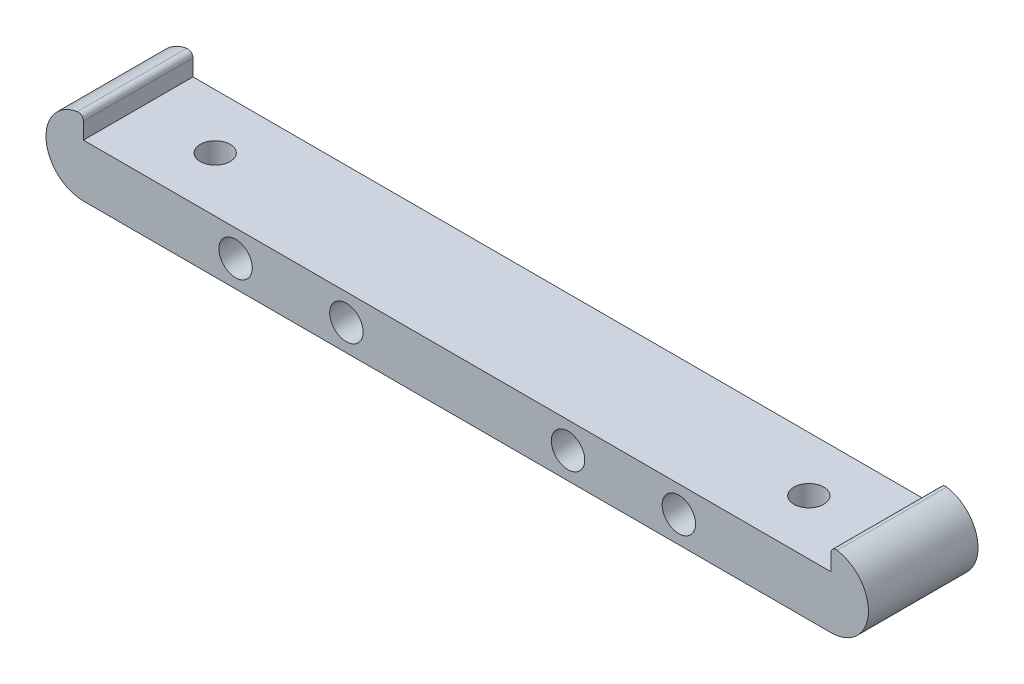
ISO-10303-21;
HEADER;
FILE_DESCRIPTION(('STEP AP214'),'2;1');
FILE_NAME('part.step','',(''),(''),'','','');
FILE_SCHEMA(('AUTOMOTIVE_DESIGN { 1 0 10303 214 1 1 1 1 }'));
ENDSEC;
DATA;
#1=APPLICATION_CONTEXT('core data for automotive mechanical design processes');
#2=APPLICATION_PROTOCOL_DEFINITION('international standard','automotive_design',2000,#1);
#3=PRODUCT_CONTEXT('',#1,'mechanical');
#4=PRODUCT('Part','Part','',(#3));
#5=PRODUCT_RELATED_PRODUCT_CATEGORY('part','',(#4));
#6=PRODUCT_DEFINITION_FORMATION('','',#4);
#7=PRODUCT_DEFINITION_CONTEXT('part definition',#1,'design');
#8=PRODUCT_DEFINITION('design','',#6,#7);
#9=PRODUCT_DEFINITION_SHAPE('','',#8);
#10=(LENGTH_UNIT() NAMED_UNIT(*) SI_UNIT(.MILLI.,.METRE.));
#11=(NAMED_UNIT(*) PLANE_ANGLE_UNIT() SI_UNIT($,.RADIAN.));
#12=(NAMED_UNIT(*) SI_UNIT($,.STERADIAN.) SOLID_ANGLE_UNIT());
#13=UNCERTAINTY_MEASURE_WITH_UNIT(LENGTH_MEASURE(1.E-05),#10,'distance_accuracy_value','');
#14=(GEOMETRIC_REPRESENTATION_CONTEXT(3) GLOBAL_UNCERTAINTY_ASSIGNED_CONTEXT((#13)) GLOBAL_UNIT_ASSIGNED_CONTEXT((#10,
#11,#12)) REPRESENTATION_CONTEXT('',''));
#15=CARTESIAN_POINT('',(0.,0.,0.));
#16=DIRECTION('',(0.,0.,1.));
#17=DIRECTION('',(1.,0.,0.));
#18=AXIS2_PLACEMENT_3D('',#15,#16,#17);
#19=CARTESIAN_POINT('',(0.,5.4102,15.8242));
#20=DIRECTION('',(0.,0.,1.));
#21=DIRECTION('',(1.,0.,0.));
#22=AXIS2_PLACEMENT_3D('',#19,#20,#21);
#23=PLANE('',#22);
#24=CARTESIAN_POINT('',(69.977,3.81,15.8242));
#25=DIRECTION('',(0.,0.,1.));
#26=DIRECTION('',(1.,0.,0.));
#27=AXIS2_PLACEMENT_3D('',#24,#25,#26);
#28=CIRCLE('',#27,2.413);
#29=CARTESIAN_POINT('',(72.39,3.81,15.8242));
#30=VERTEX_POINT('',#29);
#31=EDGE_CURVE('E187',#30,#30,#28,.T.);
#32=ORIENTED_EDGE('',*,*,#31,.F.);
#33=EDGE_LOOP('',(#32));
#34=FACE_BOUND('',#33,.T.);
#35=CARTESIAN_POINT('',(21.971,3.81,15.8242));
#36=DIRECTION('',(0.,0.,1.));
#37=DIRECTION('',(1.,0.,0.));
#38=AXIS2_PLACEMENT_3D('',#35,#36,#37);
#39=CIRCLE('',#38,2.41299999999999);
#40=CARTESIAN_POINT('',(24.384,3.81,15.8242));
#41=VERTEX_POINT('',#40);
#42=EDGE_CURVE('E175',#41,#41,#39,.T.);
#43=ORIENTED_EDGE('',*,*,#42,.F.);
#44=EDGE_LOOP('',(#43));
#45=FACE_BOUND('',#44,.T.);
#46=DIRECTION('',(0.,1.,0.));
#47=VECTOR('',#46,1.);
#48=CARTESIAN_POINT('',(0.,10.8204,15.8242));
#49=LINE('',#48,#47);
#50=CARTESIAN_POINT('',(0.,7.62,15.8242));
#51=VERTEX_POINT('',#50);
#52=CARTESIAN_POINT('',(0.,9.99551560963911,15.8242));
#53=VERTEX_POINT('',#52);
#54=EDGE_CURVE('E163',#51,#53,#49,.T.);
#55=ORIENTED_EDGE('',*,*,#54,.T.);
#56=CARTESIAN_POINT('',(-0.762,9.99551560963911,15.8242));
#57=DIRECTION('',(0.,0.,1.));
#58=DIRECTION('',(1.,0.,0.));
#59=AXIS2_PLACEMENT_3D('',#56,#57,#58);
#60=CIRCLE('',#59,0.762);
#61=CARTESIAN_POINT('',(-0.886918032786885,10.7472066931865,15.8242));
#62=VERTEX_POINT('',#61);
#63=EDGE_CURVE('E102',#53,#62,#60,.T.);
#64=ORIENTED_EDGE('',*,*,#63,.T.);
#65=CARTESIAN_POINT('',(0.,5.4102,15.8242));
#66=DIRECTION('',(0.,0.,1.));
#67=DIRECTION('',(1.,0.,0.));
#68=AXIS2_PLACEMENT_3D('',#65,#66,#67);
#69=CIRCLE('',#68,5.4102);
#70=CARTESIAN_POINT('',(0.,0.,15.8242));
#71=VERTEX_POINT('',#70);
#72=EDGE_CURVE('E95',#62,#71,#69,.T.);
#73=ORIENTED_EDGE('',*,*,#72,.T.);
#74=DIRECTION('',(1.,0.,0.));
#75=VECTOR('',#74,1.);
#76=CARTESIAN_POINT('',(0.,0.,15.8242));
#77=LINE('',#76,#75);
#78=CARTESIAN_POINT('',(107.95,0.,15.8242));
#79=VERTEX_POINT('',#78);
#80=EDGE_CURVE('E99',#71,#79,#77,.T.);
#81=ORIENTED_EDGE('',*,*,#80,.T.);
#82=CARTESIAN_POINT('',(107.95,5.4102,15.8242));
#83=DIRECTION('',(0.,0.,1.));
#84=DIRECTION('',(-1.,0.,0.));
#85=AXIS2_PLACEMENT_3D('',#82,#83,#84);
#86=CIRCLE('',#85,5.4102);
#87=CARTESIAN_POINT('',(108.836918032787,10.7472066931865,15.8242));
#88=VERTEX_POINT('',#87);
#89=EDGE_CURVE('E115',#79,#88,#86,.T.);
#90=ORIENTED_EDGE('',*,*,#89,.T.);
#91=CARTESIAN_POINT('',(108.712,9.99551560963911,15.8242));
#92=DIRECTION('',(0.,0.,1.));
#93=DIRECTION('',(1.,0.,0.));
#94=AXIS2_PLACEMENT_3D('',#91,#92,#93);
#95=CIRCLE('',#94,0.762);
#96=CARTESIAN_POINT('',(107.95,9.99551560963911,15.8242));
#97=VERTEX_POINT('',#96);
#98=EDGE_CURVE('E47',#88,#97,#95,.T.);
#99=ORIENTED_EDGE('',*,*,#98,.T.);
#100=DIRECTION('',(0.,-1.,0.));
#101=VECTOR('',#100,1.);
#102=CARTESIAN_POINT('',(107.95,10.8204,15.8242));
#103=LINE('',#102,#101);
#104=CARTESIAN_POINT('',(107.95,7.62,15.8242));
#105=VERTEX_POINT('',#104);
#106=EDGE_CURVE('E143',#97,#105,#103,.T.);
#107=ORIENTED_EDGE('',*,*,#106,.T.);
#108=DIRECTION('',(-1.,0.,0.));
#109=VECTOR('',#108,1.);
#110=CARTESIAN_POINT('',(0.,7.62,15.8242));
#111=LINE('',#110,#109);
#112=EDGE_CURVE('E168',#105,#51,#111,.T.);
#113=ORIENTED_EDGE('',*,*,#112,.T.);
#114=EDGE_LOOP('',(#55,#64,#73,#81,#90,#99,#107,#113));
#115=FACE_BOUND('',#114,.T.);
#116=CARTESIAN_POINT('',(37.973,3.81,15.8242));
#117=DIRECTION('',(0.,0.,1.));
#118=DIRECTION('',(1.,0.,0.));
#119=AXIS2_PLACEMENT_3D('',#116,#117,#118);
#120=CIRCLE('',#119,2.413);
#121=CARTESIAN_POINT('',(40.386,3.81,15.8242));
#122=VERTEX_POINT('',#121);
#123=EDGE_CURVE('E181',#122,#122,#120,.T.);
#124=ORIENTED_EDGE('',*,*,#123,.F.);
#125=EDGE_LOOP('',(#124));
#126=FACE_BOUND('',#125,.T.);
#127=CARTESIAN_POINT('',(85.979,3.81,15.8242));
#128=DIRECTION('',(0.,0.,1.));
#129=DIRECTION('',(1.,0.,0.));
#130=AXIS2_PLACEMENT_3D('',#127,#128,#129);
#131=CIRCLE('',#130,2.41300000000001);
#132=CARTESIAN_POINT('',(88.392,3.81,15.8242));
#133=VERTEX_POINT('',#132);
#134=EDGE_CURVE('E193',#133,#133,#131,.T.);
#135=ORIENTED_EDGE('',*,*,#134,.F.);
#136=EDGE_LOOP('',(#135));
#137=FACE_BOUND('',#136,.T.);
#138=ADVANCED_FACE('F32',(#34,#45,#115,#126,#137),#23,.T.);
#139=CARTESIAN_POINT('',(0.,5.4102,0.));
#140=DIRECTION('',(0.,0.,1.));
#141=DIRECTION('',(1.,0.,0.));
#142=AXIS2_PLACEMENT_3D('',#139,#140,#141);
#143=PLANE('',#142);
#144=CARTESIAN_POINT('',(0.,5.4102,0.));
#145=DIRECTION('',(0.,0.,1.));
#146=DIRECTION('',(1.,0.,0.));
#147=AXIS2_PLACEMENT_3D('',#144,#145,#146);
#148=CIRCLE('',#147,5.4102);
#149=CARTESIAN_POINT('',(-0.886918032786885,10.7472066931865,0.));
#150=VERTEX_POINT('',#149);
#151=CARTESIAN_POINT('',(0.,0.,0.));
#152=VERTEX_POINT('',#151);
#153=EDGE_CURVE('E119',#150,#152,#148,.T.);
#154=ORIENTED_EDGE('',*,*,#153,.F.);
#155=CARTESIAN_POINT('',(-0.762,9.99551560963911,0.));
#156=DIRECTION('',(0.,0.,1.));
#157=DIRECTION('',(1.,0.,0.));
#158=AXIS2_PLACEMENT_3D('',#155,#156,#157);
#159=CIRCLE('',#158,0.762);
#160=CARTESIAN_POINT('',(0.,9.99551560963911,0.));
#161=VERTEX_POINT('',#160);
#162=EDGE_CURVE('E130',#150,#161,#159,.F.);
#163=ORIENTED_EDGE('',*,*,#162,.T.);
#164=DIRECTION('',(0.,1.,0.));
#165=VECTOR('',#164,1.);
#166=CARTESIAN_POINT('',(0.,10.8204,0.));
#167=LINE('',#166,#165);
#168=CARTESIAN_POINT('',(0.,7.62,0.));
#169=VERTEX_POINT('',#168);
#170=EDGE_CURVE('E107',#169,#161,#167,.T.);
#171=ORIENTED_EDGE('',*,*,#170,.F.);
#172=DIRECTION('',(-1.,0.,0.));
#173=VECTOR('',#172,1.);
#174=CARTESIAN_POINT('',(0.,7.62,0.));
#175=LINE('',#174,#173);
#176=CARTESIAN_POINT('',(107.95,7.62,0.));
#177=VERTEX_POINT('',#176);
#178=EDGE_CURVE('E151',#177,#169,#175,.T.);
#179=ORIENTED_EDGE('',*,*,#178,.F.);
#180=DIRECTION('',(0.,-1.,0.));
#181=VECTOR('',#180,1.);
#182=CARTESIAN_POINT('',(107.95,10.8204,0.));
#183=LINE('',#182,#181);
#184=CARTESIAN_POINT('',(107.95,9.99551560963911,0.));
#185=VERTEX_POINT('',#184);
#186=EDGE_CURVE('E141',#185,#177,#183,.T.);
#187=ORIENTED_EDGE('',*,*,#186,.F.);
#188=CARTESIAN_POINT('',(108.712,9.99551560963911,0.));
#189=DIRECTION('',(0.,0.,1.));
#190=DIRECTION('',(1.,0.,0.));
#191=AXIS2_PLACEMENT_3D('',#188,#189,#190);
#192=CIRCLE('',#191,0.762);
#193=CARTESIAN_POINT('',(108.836918032787,10.7472066931865,0.));
#194=VERTEX_POINT('',#193);
#195=EDGE_CURVE('E123',#185,#194,#192,.F.);
#196=ORIENTED_EDGE('',*,*,#195,.T.);
#197=CARTESIAN_POINT('',(107.95,5.4102,0.));
#198=DIRECTION('',(0.,0.,1.));
#199=DIRECTION('',(-1.,0.,0.));
#200=AXIS2_PLACEMENT_3D('',#197,#198,#199);
#201=CIRCLE('',#200,5.4102);
#202=CARTESIAN_POINT('',(107.95,0.,0.));
#203=VERTEX_POINT('',#202);
#204=EDGE_CURVE('E152',#203,#194,#201,.T.);
#205=ORIENTED_EDGE('',*,*,#204,.F.);
#206=DIRECTION('',(1.,0.,0.));
#207=VECTOR('',#206,1.);
#208=CARTESIAN_POINT('',(0.,0.,0.));
#209=LINE('',#208,#207);
#210=EDGE_CURVE('E155',#152,#203,#209,.T.);
#211=ORIENTED_EDGE('',*,*,#210,.F.);
#212=EDGE_LOOP('',(#154,#163,#171,#179,#187,#196,#205,#211));
#213=FACE_BOUND('',#212,.T.);
#214=CARTESIAN_POINT('',(21.971,3.81,0.));
#215=DIRECTION('',(0.,0.,1.));
#216=DIRECTION('',(1.,0.,0.));
#217=AXIS2_PLACEMENT_3D('',#214,#215,#216);
#218=CIRCLE('',#217,2.41299999999999);
#219=CARTESIAN_POINT('',(24.384,3.81,0.));
#220=VERTEX_POINT('',#219);
#221=EDGE_CURVE('E178',#220,#220,#218,.T.);
#222=ORIENTED_EDGE('',*,*,#221,.T.);
#223=EDGE_LOOP('',(#222));
#224=FACE_BOUND('',#223,.T.);
#225=CARTESIAN_POINT('',(37.973,3.81,0.));
#226=DIRECTION('',(0.,0.,1.));
#227=DIRECTION('',(1.,0.,0.));
#228=AXIS2_PLACEMENT_3D('',#225,#226,#227);
#229=CIRCLE('',#228,2.413);
#230=CARTESIAN_POINT('',(40.386,3.81,0.));
#231=VERTEX_POINT('',#230);
#232=EDGE_CURVE('E184',#231,#231,#229,.T.);
#233=ORIENTED_EDGE('',*,*,#232,.T.);
#234=EDGE_LOOP('',(#233));
#235=FACE_BOUND('',#234,.T.);
#236=CARTESIAN_POINT('',(69.977,3.81,0.));
#237=DIRECTION('',(0.,0.,1.));
#238=DIRECTION('',(1.,0.,0.));
#239=AXIS2_PLACEMENT_3D('',#236,#237,#238);
#240=CIRCLE('',#239,2.413);
#241=CARTESIAN_POINT('',(72.39,3.81,0.));
#242=VERTEX_POINT('',#241);
#243=EDGE_CURVE('E190',#242,#242,#240,.T.);
#244=ORIENTED_EDGE('',*,*,#243,.T.);
#245=EDGE_LOOP('',(#244));
#246=FACE_BOUND('',#245,.T.);
#247=CARTESIAN_POINT('',(85.979,3.81,0.));
#248=DIRECTION('',(0.,0.,1.));
#249=DIRECTION('',(1.,0.,0.));
#250=AXIS2_PLACEMENT_3D('',#247,#248,#249);
#251=CIRCLE('',#250,2.41300000000001);
#252=CARTESIAN_POINT('',(88.392,3.81,0.));
#253=VERTEX_POINT('',#252);
#254=EDGE_CURVE('E196',#253,#253,#251,.T.);
#255=ORIENTED_EDGE('',*,*,#254,.T.);
#256=EDGE_LOOP('',(#255));
#257=FACE_BOUND('',#256,.T.);
#258=ADVANCED_FACE('F147',(#213,#224,#235,#246,#257),#143,.F.);
#259=CARTESIAN_POINT('',(0.,5.4102,15.8242));
#260=DIRECTION('',(0.,0.,-1.));
#261=DIRECTION('',(-1.,0.,0.));
#262=AXIS2_PLACEMENT_3D('',#259,#260,#261);
#263=CYLINDRICAL_SURFACE('',#262,5.4102);
#264=ORIENTED_EDGE('',*,*,#72,.F.);
#265=DIRECTION('',(0.,0.,-1.));
#266=VECTOR('',#265,1.);
#267=CARTESIAN_POINT('',(-0.886918032786885,10.7472066931865,15.8242));
#268=LINE('',#267,#266);
#269=EDGE_CURVE('E121',#62,#150,#268,.T.);
#270=ORIENTED_EDGE('',*,*,#269,.T.);
#271=ORIENTED_EDGE('',*,*,#153,.T.);
#272=DIRECTION('',(0.,0.,-1.));
#273=VECTOR('',#272,1.);
#274=CARTESIAN_POINT('',(0.,0.,15.8242));
#275=LINE('',#274,#273);
#276=EDGE_CURVE('E112',#71,#152,#275,.T.);
#277=ORIENTED_EDGE('',*,*,#276,.F.);
#278=EDGE_LOOP('',(#264,#270,#271,#277));
#279=FACE_BOUND('',#278,.T.);
#280=ADVANCED_FACE('F117',(#279),#263,.T.);
#281=CARTESIAN_POINT('',(0.,0.,15.8242));
#282=DIRECTION('',(0.,1.,0.));
#283=DIRECTION('',(0.,0.,1.));
#284=AXIS2_PLACEMENT_3D('',#281,#282,#283);
#285=PLANE('',#284);
#286=CARTESIAN_POINT('',(96.8375,0.,7.91209999999995));
#287=DIRECTION('',(0.,1.,0.));
#288=DIRECTION('',(0.,0.,1.));
#289=AXIS2_PLACEMENT_3D('',#286,#287,#288);
#290=CIRCLE('',#289,2.15899999999999);
#291=CARTESIAN_POINT('',(96.8375,0.,10.0710999999999));
#292=VERTEX_POINT('',#291);
#293=EDGE_CURVE('E199',#292,#292,#290,.F.);
#294=ORIENTED_EDGE('',*,*,#293,.F.);
#295=EDGE_LOOP('',(#294));
#296=FACE_BOUND('',#295,.T.);
#297=CARTESIAN_POINT('',(11.1125,0.,7.9121));
#298=DIRECTION('',(0.,1.,0.));
#299=DIRECTION('',(0.,0.,1.));
#300=AXIS2_PLACEMENT_3D('',#297,#298,#299);
#301=CIRCLE('',#300,2.159);
#302=CARTESIAN_POINT('',(11.1125,0.,10.0711));
#303=VERTEX_POINT('',#302);
#304=EDGE_CURVE('E202',#303,#303,#301,.F.);
#305=ORIENTED_EDGE('',*,*,#304,.F.);
#306=EDGE_LOOP('',(#305));
#307=FACE_BOUND('',#306,.T.);
#308=ORIENTED_EDGE('',*,*,#210,.T.);
#309=DIRECTION('',(0.,0.,-1.));
#310=VECTOR('',#309,1.);
#311=CARTESIAN_POINT('',(107.95,0.,15.8242));
#312=LINE('',#311,#310);
#313=EDGE_CURVE('E114',#79,#203,#312,.T.);
#314=ORIENTED_EDGE('',*,*,#313,.F.);
#315=ORIENTED_EDGE('',*,*,#80,.F.);
#316=ORIENTED_EDGE('',*,*,#276,.T.);
#317=EDGE_LOOP('',(#308,#314,#315,#316));
#318=FACE_BOUND('',#317,.T.);
#319=ADVANCED_FACE('F111',(#296,#307,#318),#285,.F.);
#320=CARTESIAN_POINT('',(107.95,5.4102,15.8242));
#321=DIRECTION('',(0.,0.,-1.));
#322=DIRECTION('',(-1.,0.,0.));
#323=AXIS2_PLACEMENT_3D('',#320,#321,#322);
#324=CYLINDRICAL_SURFACE('',#323,5.4102);
#325=ORIENTED_EDGE('',*,*,#204,.T.);
#326=DIRECTION('',(0.,0.,-1.));
#327=VECTOR('',#326,1.);
#328=CARTESIAN_POINT('',(108.836918032787,10.7472066931865,15.8242));
#329=LINE('',#328,#327);
#330=EDGE_CURVE('E11',#194,#88,#329,.F.);
#331=ORIENTED_EDGE('',*,*,#330,.T.);
#332=ORIENTED_EDGE('',*,*,#89,.F.);
#333=ORIENTED_EDGE('',*,*,#313,.T.);
#334=EDGE_LOOP('',(#325,#331,#332,#333));
#335=FACE_BOUND('',#334,.T.);
#336=ADVANCED_FACE('F176',(#335),#324,.T.);
#337=CARTESIAN_POINT('',(107.95,10.8204,15.8242));
#338=DIRECTION('',(1.,0.,0.));
#339=DIRECTION('',(0.,0.,-1.));
#340=AXIS2_PLACEMENT_3D('',#337,#338,#339);
#341=PLANE('',#340);
#342=ORIENTED_EDGE('',*,*,#106,.F.);
#343=DIRECTION('',(0.,0.,-1.));
#344=VECTOR('',#343,1.);
#345=CARTESIAN_POINT('',(107.95,9.99551560963911,15.8242));
#346=LINE('',#345,#344);
#347=EDGE_CURVE('E40',#97,#185,#346,.T.);
#348=ORIENTED_EDGE('',*,*,#347,.T.);
#349=ORIENTED_EDGE('',*,*,#186,.T.);
#350=DIRECTION('',(0.,0.,-1.));
#351=VECTOR('',#350,1.);
#352=CARTESIAN_POINT('',(107.95,7.62,15.8242));
#353=LINE('',#352,#351);
#354=EDGE_CURVE('E125',#105,#177,#353,.T.);
#355=ORIENTED_EDGE('',*,*,#354,.F.);
#356=EDGE_LOOP('',(#342,#348,#349,#355));
#357=FACE_BOUND('',#356,.T.);
#358=ADVANCED_FACE('F139',(#357),#341,.F.);
#359=CARTESIAN_POINT('',(0.,7.62,15.8242));
#360=DIRECTION('',(0.,-1.,0.));
#361=DIRECTION('',(1.,0.,0.));
#362=AXIS2_PLACEMENT_3D('',#359,#360,#361);
#363=PLANE('',#362);
#364=CARTESIAN_POINT('',(96.8375,7.62,7.91209999999995));
#365=DIRECTION('',(0.,1.,0.));
#366=DIRECTION('',(-1.,0.,0.));
#367=AXIS2_PLACEMENT_3D('',#364,#365,#366);
#368=CIRCLE('',#367,2.15899999999999);
#369=CARTESIAN_POINT('',(94.6785,7.62,7.91209999999995));
#370=VERTEX_POINT('',#369);
#371=EDGE_CURVE('E205',#370,#370,#368,.T.);
#372=ORIENTED_EDGE('',*,*,#371,.F.);
#373=EDGE_LOOP('',(#372));
#374=FACE_BOUND('',#373,.T.);
#375=CARTESIAN_POINT('',(11.1125,7.62,7.9121));
#376=DIRECTION('',(0.,1.,0.));
#377=DIRECTION('',(-1.,0.,0.));
#378=AXIS2_PLACEMENT_3D('',#375,#376,#377);
#379=CIRCLE('',#378,2.159);
#380=CARTESIAN_POINT('',(8.9535,7.62,7.9121));
#381=VERTEX_POINT('',#380);
#382=EDGE_CURVE('E206',#381,#381,#379,.T.);
#383=ORIENTED_EDGE('',*,*,#382,.F.);
#384=EDGE_LOOP('',(#383));
#385=FACE_BOUND('',#384,.T.);
#386=ORIENTED_EDGE('',*,*,#178,.T.);
#387=DIRECTION('',(0.,0.,-1.));
#388=VECTOR('',#387,1.);
#389=CARTESIAN_POINT('',(0.,7.62,15.8242));
#390=LINE('',#389,#388);
#391=EDGE_CURVE('E161',#51,#169,#390,.T.);
#392=ORIENTED_EDGE('',*,*,#391,.F.);
#393=ORIENTED_EDGE('',*,*,#112,.F.);
#394=ORIENTED_EDGE('',*,*,#354,.T.);
#395=EDGE_LOOP('',(#386,#392,#393,#394));
#396=FACE_BOUND('',#395,.T.);
#397=ADVANCED_FACE('F166',(#374,#385,#396),#363,.F.);
#398=CARTESIAN_POINT('',(0.,10.8204,15.8242));
#399=DIRECTION('',(-1.,0.,0.));
#400=DIRECTION('',(0.,-1.,0.));
#401=AXIS2_PLACEMENT_3D('',#398,#399,#400);
#402=PLANE('',#401);
#403=ORIENTED_EDGE('',*,*,#170,.T.);
#404=DIRECTION('',(0.,0.,-1.));
#405=VECTOR('',#404,1.);
#406=CARTESIAN_POINT('',(0.,9.99551560963911,15.8242));
#407=LINE('',#406,#405);
#408=EDGE_CURVE('E132',#161,#53,#407,.F.);
#409=ORIENTED_EDGE('',*,*,#408,.T.);
#410=ORIENTED_EDGE('',*,*,#54,.F.);
#411=ORIENTED_EDGE('',*,*,#391,.T.);
#412=EDGE_LOOP('',(#403,#409,#410,#411));
#413=FACE_BOUND('',#412,.T.);
#414=ADVANCED_FACE('F218',(#413),#402,.F.);
#415=CARTESIAN_POINT('',(21.971,3.81,15.8242));
#416=DIRECTION('',(0.,0.,-1.));
#417=DIRECTION('',(-1.,0.,0.));
#418=AXIS2_PLACEMENT_3D('',#415,#416,#417);
#419=CYLINDRICAL_SURFACE('',#418,2.41299999999999);
#420=ORIENTED_EDGE('',*,*,#42,.T.);
#421=EDGE_LOOP('',(#420));
#422=FACE_BOUND('',#421,.T.);
#423=ORIENTED_EDGE('',*,*,#221,.F.);
#424=EDGE_LOOP('',(#423));
#425=FACE_BOUND('',#424,.T.);
#426=ADVANCED_FACE('F248',(#422,#425),#419,.F.);
#427=CARTESIAN_POINT('',(37.973,3.81,15.8242));
#428=DIRECTION('',(0.,0.,-1.));
#429=DIRECTION('',(-1.,0.,0.));
#430=AXIS2_PLACEMENT_3D('',#427,#428,#429);
#431=CYLINDRICAL_SURFACE('',#430,2.413);
#432=ORIENTED_EDGE('',*,*,#123,.T.);
#433=EDGE_LOOP('',(#432));
#434=FACE_BOUND('',#433,.T.);
#435=ORIENTED_EDGE('',*,*,#232,.F.);
#436=EDGE_LOOP('',(#435));
#437=FACE_BOUND('',#436,.T.);
#438=ADVANCED_FACE('F329',(#434,#437),#431,.F.);
#439=CARTESIAN_POINT('',(69.977,3.81,15.8242));
#440=DIRECTION('',(0.,0.,-1.));
#441=DIRECTION('',(-1.,0.,0.));
#442=AXIS2_PLACEMENT_3D('',#439,#440,#441);
#443=CYLINDRICAL_SURFACE('',#442,2.413);
#444=ORIENTED_EDGE('',*,*,#31,.T.);
#445=EDGE_LOOP('',(#444));
#446=FACE_BOUND('',#445,.T.);
#447=ORIENTED_EDGE('',*,*,#243,.F.);
#448=EDGE_LOOP('',(#447));
#449=FACE_BOUND('',#448,.T.);
#450=ADVANCED_FACE('F234',(#446,#449),#443,.F.);
#451=CARTESIAN_POINT('',(85.979,3.81,15.8242));
#452=DIRECTION('',(0.,0.,-1.));
#453=DIRECTION('',(-1.,0.,0.));
#454=AXIS2_PLACEMENT_3D('',#451,#452,#453);
#455=CYLINDRICAL_SURFACE('',#454,2.41300000000001);
#456=ORIENTED_EDGE('',*,*,#134,.T.);
#457=EDGE_LOOP('',(#456));
#458=FACE_BOUND('',#457,.T.);
#459=ORIENTED_EDGE('',*,*,#254,.F.);
#460=EDGE_LOOP('',(#459));
#461=FACE_BOUND('',#460,.T.);
#462=ADVANCED_FACE('F224',(#458,#461),#455,.F.);
#463=CARTESIAN_POINT('',(11.1125,-6.10657416232703,7.9121));
#464=DIRECTION('',(0.,1.,0.));
#465=DIRECTION('',(-1.,0.,0.));
#466=AXIS2_PLACEMENT_3D('',#463,#464,#465);
#467=CYLINDRICAL_SURFACE('',#466,2.159);
#468=ORIENTED_EDGE('',*,*,#304,.T.);
#469=EDGE_LOOP('',(#468));
#470=FACE_BOUND('',#469,.T.);
#471=ORIENTED_EDGE('',*,*,#382,.T.);
#472=EDGE_LOOP('',(#471));
#473=FACE_BOUND('',#472,.T.);
#474=ADVANCED_FACE('F222',(#470,#473),#467,.F.);
#475=CARTESIAN_POINT('',(96.8375,-6.10657416232702,7.91209999999995));
#476=DIRECTION('',(0.,1.,0.));
#477=DIRECTION('',(-1.,0.,0.));
#478=AXIS2_PLACEMENT_3D('',#475,#476,#477);
#479=CYLINDRICAL_SURFACE('',#478,2.15899999999999);
#480=ORIENTED_EDGE('',*,*,#293,.T.);
#481=EDGE_LOOP('',(#480));
#482=FACE_BOUND('',#481,.T.);
#483=ORIENTED_EDGE('',*,*,#371,.T.);
#484=EDGE_LOOP('',(#483));
#485=FACE_BOUND('',#484,.T.);
#486=ADVANCED_FACE('F214',(#482,#485),#479,.F.);
#487=CARTESIAN_POINT('',(-0.762,9.99551560963911,15.8242));
#488=DIRECTION('',(0.,0.,-1.));
#489=DIRECTION('',(-1.,0.,0.));
#490=AXIS2_PLACEMENT_3D('',#487,#488,#489);
#491=CYLINDRICAL_SURFACE('',#490,0.762);
#492=ORIENTED_EDGE('',*,*,#63,.F.);
#493=ORIENTED_EDGE('',*,*,#408,.F.);
#494=ORIENTED_EDGE('',*,*,#162,.F.);
#495=ORIENTED_EDGE('',*,*,#269,.F.);
#496=EDGE_LOOP('',(#492,#493,#494,#495));
#497=FACE_BOUND('',#496,.T.);
#498=ADVANCED_FACE('F231',(#497),#491,.T.);
#499=CARTESIAN_POINT('',(108.712,9.99551560963911,15.8242));
#500=DIRECTION('',(0.,0.,-1.));
#501=DIRECTION('',(-1.,0.,0.));
#502=AXIS2_PLACEMENT_3D('',#499,#500,#501);
#503=CYLINDRICAL_SURFACE('',#502,0.762);
#504=ORIENTED_EDGE('',*,*,#98,.F.);
#505=ORIENTED_EDGE('',*,*,#330,.F.);
#506=ORIENTED_EDGE('',*,*,#195,.F.);
#507=ORIENTED_EDGE('',*,*,#347,.F.);
#508=EDGE_LOOP('',(#504,#505,#506,#507));
#509=FACE_BOUND('',#508,.T.);
#510=ADVANCED_FACE('F34',(#509),#503,.T.);
#511=CLOSED_SHELL('',(#138,#258,#280,#319,#336,#358,#397,#414,#426,#438,#450,#462,#474,#486,
#498,#510));
#512=MANIFOLD_SOLID_BREP('B2',#511);
#513=ADVANCED_BREP_SHAPE_REPRESENTATION('',(#18,#512),#14);
#514=SHAPE_DEFINITION_REPRESENTATION(#9,#513);
ENDSEC;
END-ISO-10303-21;
